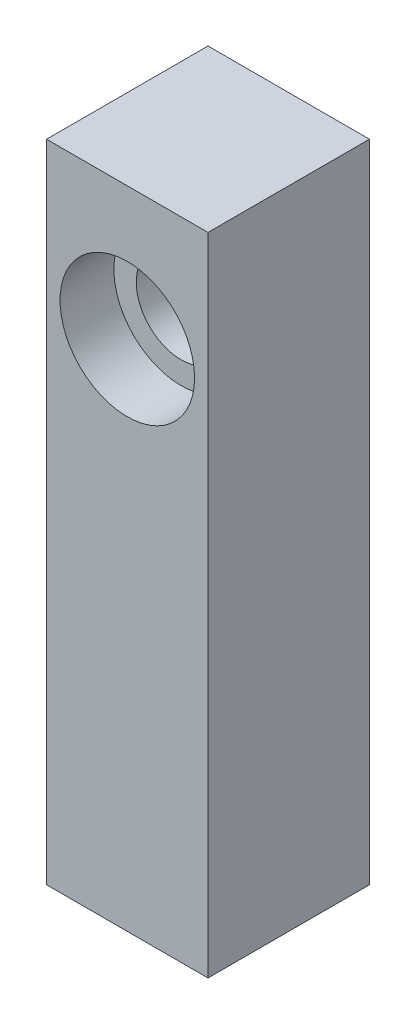
ISO-10303-21;
HEADER;
FILE_DESCRIPTION(('STEP AP214'),'2;1');
FILE_NAME('part.step','',(''),(''),'','','');
FILE_SCHEMA(('AUTOMOTIVE_DESIGN { 1 0 10303 214 1 1 1 1 }'));
ENDSEC;
DATA;
#1=APPLICATION_CONTEXT('core data for automotive mechanical design processes');
#2=APPLICATION_PROTOCOL_DEFINITION('international standard','automotive_design',2000,#1);
#3=PRODUCT_CONTEXT('',#1,'mechanical');
#4=PRODUCT('Part','Part','',(#3));
#5=PRODUCT_RELATED_PRODUCT_CATEGORY('part','',(#4));
#6=PRODUCT_DEFINITION_FORMATION('','',#4);
#7=PRODUCT_DEFINITION_CONTEXT('part definition',#1,'design');
#8=PRODUCT_DEFINITION('design','',#6,#7);
#9=PRODUCT_DEFINITION_SHAPE('','',#8);
#10=(LENGTH_UNIT() NAMED_UNIT(*) SI_UNIT(.MILLI.,.METRE.));
#11=(NAMED_UNIT(*) PLANE_ANGLE_UNIT() SI_UNIT($,.RADIAN.));
#12=(NAMED_UNIT(*) SI_UNIT($,.STERADIAN.) SOLID_ANGLE_UNIT());
#13=UNCERTAINTY_MEASURE_WITH_UNIT(LENGTH_MEASURE(1.E-05),#10,'distance_accuracy_value','');
#14=(GEOMETRIC_REPRESENTATION_CONTEXT(3) GLOBAL_UNCERTAINTY_ASSIGNED_CONTEXT((#13)) GLOBAL_UNIT_ASSIGNED_CONTEXT((#10,
#11,#12)) REPRESENTATION_CONTEXT('',''));
#15=CARTESIAN_POINT('',(0.,0.,0.));
#16=DIRECTION('',(0.,0.,1.));
#17=DIRECTION('',(1.,0.,0.));
#18=AXIS2_PLACEMENT_3D('',#15,#16,#17);
#19=CARTESIAN_POINT('',(-33.9587628865979,57.2,-13.2680412371134));
#20=DIRECTION('',(0.,0.,1.));
#21=DIRECTION('',(1.,0.,0.));
#22=AXIS2_PLACEMENT_3D('',#19,#20,#21);
#23=CYLINDRICAL_SURFACE('',#22,5.);
#24=CARTESIAN_POINT('',(-33.9587628865979,57.2,-13.2680412371134));
#25=DIRECTION('',(0.,0.,1.));
#26=DIRECTION('',(1.,0.,0.));
#27=AXIS2_PLACEMENT_3D('',#24,#25,#26);
#28=CIRCLE('',#27,5.);
#29=CARTESIAN_POINT('',(-28.9587628865979,57.2,-13.2680412371134));
#30=VERTEX_POINT('',#29);
#31=EDGE_CURVE('E111',#30,#30,#28,.T.);
#32=ORIENTED_EDGE('',*,*,#31,.F.);
#33=EDGE_LOOP('',(#32));
#34=FACE_BOUND('',#33,.T.);
#35=CARTESIAN_POINT('',(-33.9587628865979,57.2,-1.26804123711341));
#36=DIRECTION('',(0.,0.,1.));
#37=DIRECTION('',(1.,0.,0.));
#38=AXIS2_PLACEMENT_3D('',#35,#36,#37);
#39=CIRCLE('',#38,5.);
#40=CARTESIAN_POINT('',(-28.9587628865979,57.2,-1.26804123711341));
#41=VERTEX_POINT('',#40);
#42=EDGE_CURVE('E52',#41,#41,#39,.F.);
#43=ORIENTED_EDGE('',*,*,#42,.F.);
#44=EDGE_LOOP('',(#43));
#45=FACE_BOUND('',#44,.T.);
#46=ADVANCED_FACE('F48',(#34,#45),#23,.F.);
#47=CARTESIAN_POINT('',(-42.9587628865979,72.,4.73195876288659));
#48=DIRECTION('',(1.,0.,0.));
#49=DIRECTION('',(0.,0.,-1.));
#50=AXIS2_PLACEMENT_3D('',#47,#48,#49);
#51=PLANE('',#50);
#52=DIRECTION('',(0.,0.,1.));
#53=VECTOR('',#52,1.);
#54=CARTESIAN_POINT('',(-42.9587628865979,0.,4.73195876288659));
#55=LINE('',#54,#53);
#56=CARTESIAN_POINT('',(-42.9587628865979,0.,-13.2680412371134));
#57=VERTEX_POINT('',#56);
#58=CARTESIAN_POINT('',(-42.9587628865979,0.,4.73195876288659));
#59=VERTEX_POINT('',#58);
#60=EDGE_CURVE('E115',#57,#59,#55,.T.);
#61=ORIENTED_EDGE('',*,*,#60,.T.);
#62=DIRECTION('',(0.,-1.,0.));
#63=VECTOR('',#62,1.);
#64=CARTESIAN_POINT('',(-42.9587628865979,72.,4.73195876288659));
#65=LINE('',#64,#63);
#66=CARTESIAN_POINT('',(-42.9587628865979,72.,4.73195876288659));
#67=VERTEX_POINT('',#66);
#68=EDGE_CURVE('E11',#67,#59,#65,.T.);
#69=ORIENTED_EDGE('',*,*,#68,.F.);
#70=DIRECTION('',(0.,0.,1.));
#71=VECTOR('',#70,1.);
#72=CARTESIAN_POINT('',(-42.9587628865979,72.,4.73195876288659));
#73=LINE('',#72,#71);
#74=CARTESIAN_POINT('',(-42.9587628865979,72.,-13.2680412371134));
#75=VERTEX_POINT('',#74);
#76=EDGE_CURVE('E121',#75,#67,#73,.T.);
#77=ORIENTED_EDGE('',*,*,#76,.F.);
#78=DIRECTION('',(0.,-1.,0.));
#79=VECTOR('',#78,1.);
#80=CARTESIAN_POINT('',(-42.9587628865979,72.,-13.2680412371134));
#81=LINE('',#80,#79);
#82=EDGE_CURVE('E127',#75,#57,#81,.T.);
#83=ORIENTED_EDGE('',*,*,#82,.T.);
#84=EDGE_LOOP('',(#61,#69,#77,#83));
#85=FACE_BOUND('',#84,.T.);
#86=ADVANCED_FACE('F50',(#85),#51,.F.);
#87=CARTESIAN_POINT('',(-42.9587628865979,72.,4.73195876288659));
#88=DIRECTION('',(0.,0.,-1.));
#89=DIRECTION('',(-1.,0.,0.));
#90=AXIS2_PLACEMENT_3D('',#87,#88,#89);
#91=PLANE('',#90);
#92=CARTESIAN_POINT('',(-33.9587628865979,57.2,4.73195876288659));
#93=DIRECTION('',(0.,0.,1.));
#94=DIRECTION('',(1.,0.,0.));
#95=AXIS2_PLACEMENT_3D('',#92,#93,#94);
#96=CIRCLE('',#95,7.5);
#97=CARTESIAN_POINT('',(-26.4587628865979,57.2,4.73195876288659));
#98=VERTEX_POINT('',#97);
#99=EDGE_CURVE('E191',#98,#98,#96,.T.);
#100=ORIENTED_EDGE('',*,*,#99,.F.);
#101=EDGE_LOOP('',(#100));
#102=FACE_BOUND('',#101,.T.);
#103=DIRECTION('',(1.,0.,0.));
#104=VECTOR('',#103,1.);
#105=CARTESIAN_POINT('',(-42.9587628865979,0.,4.73195876288659));
#106=LINE('',#105,#104);
#107=CARTESIAN_POINT('',(-24.9587628865979,0.,4.73195876288659));
#108=VERTEX_POINT('',#107);
#109=EDGE_CURVE('E130',#59,#108,#106,.T.);
#110=ORIENTED_EDGE('',*,*,#109,.T.);
#111=DIRECTION('',(0.,-1.,0.));
#112=VECTOR('',#111,1.);
#113=CARTESIAN_POINT('',(-24.9587628865979,72.,4.73195876288659));
#114=LINE('',#113,#112);
#115=CARTESIAN_POINT('',(-24.9587628865979,72.,4.73195876288659));
#116=VERTEX_POINT('',#115);
#117=EDGE_CURVE('E58',#116,#108,#114,.T.);
#118=ORIENTED_EDGE('',*,*,#117,.F.);
#119=DIRECTION('',(1.,0.,0.));
#120=VECTOR('',#119,1.);
#121=CARTESIAN_POINT('',(-42.9587628865979,72.,4.73195876288659));
#122=LINE('',#121,#120);
#123=EDGE_CURVE('E97',#67,#116,#122,.T.);
#124=ORIENTED_EDGE('',*,*,#123,.F.);
#125=ORIENTED_EDGE('',*,*,#68,.T.);
#126=EDGE_LOOP('',(#110,#118,#124,#125));
#127=FACE_BOUND('',#126,.T.);
#128=ADVANCED_FACE('F154',(#102,#127),#91,.F.);
#129=CARTESIAN_POINT('',(-24.9587628865979,72.,4.73195876288659));
#130=DIRECTION('',(-1.,0.,0.));
#131=DIRECTION('',(0.,0.,1.));
#132=AXIS2_PLACEMENT_3D('',#129,#130,#131);
#133=PLANE('',#132);
#134=DIRECTION('',(0.,0.,-1.));
#135=VECTOR('',#134,1.);
#136=CARTESIAN_POINT('',(-24.9587628865979,0.,4.73195876288659));
#137=LINE('',#136,#135);
#138=CARTESIAN_POINT('',(-24.9587628865979,0.,-13.2680412371134));
#139=VERTEX_POINT('',#138);
#140=EDGE_CURVE('E84',#108,#139,#137,.T.);
#141=ORIENTED_EDGE('',*,*,#140,.T.);
#142=DIRECTION('',(0.,-1.,0.));
#143=VECTOR('',#142,1.);
#144=CARTESIAN_POINT('',(-24.9587628865979,72.,-13.2680412371134));
#145=LINE('',#144,#143);
#146=CARTESIAN_POINT('',(-24.9587628865979,72.,-13.2680412371134));
#147=VERTEX_POINT('',#146);
#148=EDGE_CURVE('E135',#147,#139,#145,.T.);
#149=ORIENTED_EDGE('',*,*,#148,.F.);
#150=DIRECTION('',(0.,0.,-1.));
#151=VECTOR('',#150,1.);
#152=CARTESIAN_POINT('',(-24.9587628865979,72.,4.73195876288659));
#153=LINE('',#152,#151);
#154=EDGE_CURVE('E124',#116,#147,#153,.T.);
#155=ORIENTED_EDGE('',*,*,#154,.F.);
#156=ORIENTED_EDGE('',*,*,#117,.T.);
#157=EDGE_LOOP('',(#141,#149,#155,#156));
#158=FACE_BOUND('',#157,.T.);
#159=ADVANCED_FACE('F138',(#158),#133,.F.);
#160=CARTESIAN_POINT('',(-42.9587628865979,72.,-13.2680412371134));
#161=DIRECTION('',(0.,0.,1.));
#162=DIRECTION('',(1.,0.,0.));
#163=AXIS2_PLACEMENT_3D('',#160,#161,#162);
#164=PLANE('',#163);
#165=ORIENTED_EDGE('',*,*,#31,.T.);
#166=EDGE_LOOP('',(#165));
#167=FACE_BOUND('',#166,.T.);
#168=DIRECTION('',(-1.,0.,0.));
#169=VECTOR('',#168,1.);
#170=CARTESIAN_POINT('',(-42.9587628865979,0.,-13.2680412371134));
#171=LINE('',#170,#169);
#172=EDGE_CURVE('E90',#139,#57,#171,.T.);
#173=ORIENTED_EDGE('',*,*,#172,.T.);
#174=ORIENTED_EDGE('',*,*,#82,.F.);
#175=DIRECTION('',(-1.,0.,0.));
#176=VECTOR('',#175,1.);
#177=CARTESIAN_POINT('',(-42.9587628865979,72.,-13.2680412371134));
#178=LINE('',#177,#176);
#179=EDGE_CURVE('E66',#147,#75,#178,.T.);
#180=ORIENTED_EDGE('',*,*,#179,.F.);
#181=ORIENTED_EDGE('',*,*,#148,.T.);
#182=EDGE_LOOP('',(#173,#174,#180,#181));
#183=FACE_BOUND('',#182,.T.);
#184=ADVANCED_FACE('F144',(#167,#183),#164,.F.);
#185=CARTESIAN_POINT('',(0.,72.,0.));
#186=DIRECTION('',(0.,-1.,0.));
#187=DIRECTION('',(0.,0.,-1.));
#188=AXIS2_PLACEMENT_3D('',#185,#186,#187);
#189=PLANE('',#188);
#190=ORIENTED_EDGE('',*,*,#76,.T.);
#191=ORIENTED_EDGE('',*,*,#123,.T.);
#192=ORIENTED_EDGE('',*,*,#154,.T.);
#193=ORIENTED_EDGE('',*,*,#179,.T.);
#194=EDGE_LOOP('',(#190,#191,#192,#193));
#195=FACE_BOUND('',#194,.T.);
#196=ADVANCED_FACE('F146',(#195),#189,.F.);
#197=CARTESIAN_POINT('',(0.,0.,0.));
#198=DIRECTION('',(0.,-1.,0.));
#199=DIRECTION('',(0.,0.,-1.));
#200=AXIS2_PLACEMENT_3D('',#197,#198,#199);
#201=PLANE('',#200);
#202=CARTESIAN_POINT('',(-33.9587628865979,0.,-4.26804123711341));
#203=DIRECTION('',(0.,-1.,0.));
#204=DIRECTION('',(0.,0.,-1.));
#205=AXIS2_PLACEMENT_3D('',#202,#203,#204);
#206=CIRCLE('',#205,2.49999999999999);
#207=CARTESIAN_POINT('',(-33.9587628865979,0.,-6.7680412371134));
#208=VERTEX_POINT('',#207);
#209=EDGE_CURVE('E112',#208,#208,#206,.T.);
#210=ORIENTED_EDGE('',*,*,#209,.F.);
#211=EDGE_LOOP('',(#210));
#212=FACE_BOUND('',#211,.T.);
#213=ORIENTED_EDGE('',*,*,#60,.F.);
#214=ORIENTED_EDGE('',*,*,#172,.F.);
#215=ORIENTED_EDGE('',*,*,#140,.F.);
#216=ORIENTED_EDGE('',*,*,#109,.F.);
#217=EDGE_LOOP('',(#213,#214,#215,#216));
#218=FACE_BOUND('',#217,.T.);
#219=ADVANCED_FACE('F105',(#212,#218),#201,.T.);
#220=CARTESIAN_POINT('',(-33.9587628865979,29.,-4.26804123711341));
#221=DIRECTION('',(0.,-1.,0.));
#222=DIRECTION('',(0.,0.,-1.));
#223=AXIS2_PLACEMENT_3D('',#220,#221,#222);
#224=CONICAL_SURFACE('',#223,2.49999999999999,1.02974425867665);
#225=CARTESIAN_POINT('',(-33.9587628865979,30.5021515475689,-4.26804123711341));
#226=VERTEX_POINT('',#225);
#227=VERTEX_LOOP('',#226);
#228=FACE_BOUND('',#227,.T.);
#229=CARTESIAN_POINT('',(-33.9587628865979,29.,-4.26804123711341));
#230=DIRECTION('',(0.,-1.,0.));
#231=DIRECTION('',(0.,0.,-1.));
#232=AXIS2_PLACEMENT_3D('',#229,#230,#231);
#233=CIRCLE('',#232,2.49999999999999);
#234=CARTESIAN_POINT('',(-33.9587628865979,29.,-6.7680412371134));
#235=VERTEX_POINT('',#234);
#236=EDGE_CURVE('E109',#235,#235,#233,.T.);
#237=ORIENTED_EDGE('',*,*,#236,.T.);
#238=EDGE_LOOP('',(#237));
#239=FACE_BOUND('',#238,.T.);
#240=ADVANCED_FACE('F101',(#228,#239),#224,.F.);
#241=CARTESIAN_POINT('',(-33.9587628865979,0.,-4.26804123711341));
#242=DIRECTION('',(0.,-1.,0.));
#243=DIRECTION('',(0.,0.,-1.));
#244=AXIS2_PLACEMENT_3D('',#241,#242,#243);
#245=CYLINDRICAL_SURFACE('',#244,2.49999999999999);
#246=ORIENTED_EDGE('',*,*,#236,.F.);
#247=EDGE_LOOP('',(#246));
#248=FACE_BOUND('',#247,.T.);
#249=ORIENTED_EDGE('',*,*,#209,.T.);
#250=EDGE_LOOP('',(#249));
#251=FACE_BOUND('',#250,.T.);
#252=ADVANCED_FACE('F104',(#248,#251),#245,.F.);
#253=CARTESIAN_POINT('',(-33.9587628865979,57.2,-1.26804123711341));
#254=DIRECTION('',(0.,0.,1.));
#255=DIRECTION('',(1.,0.,0.));
#256=AXIS2_PLACEMENT_3D('',#253,#254,#255);
#257=PLANE('',#256);
#258=CARTESIAN_POINT('',(-33.9587628865979,57.2,-1.26804123711341));
#259=DIRECTION('',(0.,0.,1.));
#260=DIRECTION('',(1.,0.,0.));
#261=AXIS2_PLACEMENT_3D('',#258,#259,#260);
#262=CIRCLE('',#261,7.5);
#263=CARTESIAN_POINT('',(-26.4587628865979,57.2,-1.26804123711341));
#264=VERTEX_POINT('',#263);
#265=EDGE_CURVE('E188',#264,#264,#262,.T.);
#266=ORIENTED_EDGE('',*,*,#265,.T.);
#267=EDGE_LOOP('',(#266));
#268=FACE_BOUND('',#267,.T.);
#269=ORIENTED_EDGE('',*,*,#42,.T.);
#270=EDGE_LOOP('',(#269));
#271=FACE_BOUND('',#270,.T.);
#272=ADVANCED_FACE('F173',(#268,#271),#257,.T.);
#273=CARTESIAN_POINT('',(-33.9587628865979,57.2,-1.26804123711341));
#274=DIRECTION('',(0.,0.,1.));
#275=DIRECTION('',(1.,0.,0.));
#276=AXIS2_PLACEMENT_3D('',#273,#274,#275);
#277=CYLINDRICAL_SURFACE('',#276,7.5);
#278=ORIENTED_EDGE('',*,*,#265,.F.);
#279=EDGE_LOOP('',(#278));
#280=FACE_BOUND('',#279,.T.);
#281=ORIENTED_EDGE('',*,*,#99,.T.);
#282=EDGE_LOOP('',(#281));
#283=FACE_BOUND('',#282,.T.);
#284=ADVANCED_FACE('F177',(#280,#283),#277,.F.);
#285=CLOSED_SHELL('',(#46,#86,#128,#159,#184,#196,#219,#240,#252,#272,#284));
#286=MANIFOLD_SOLID_BREP('B2',#285);
#287=ADVANCED_BREP_SHAPE_REPRESENTATION('',(#18,#286),#14);
#288=SHAPE_DEFINITION_REPRESENTATION(#9,#287);
ENDSEC;
END-ISO-10303-21;
